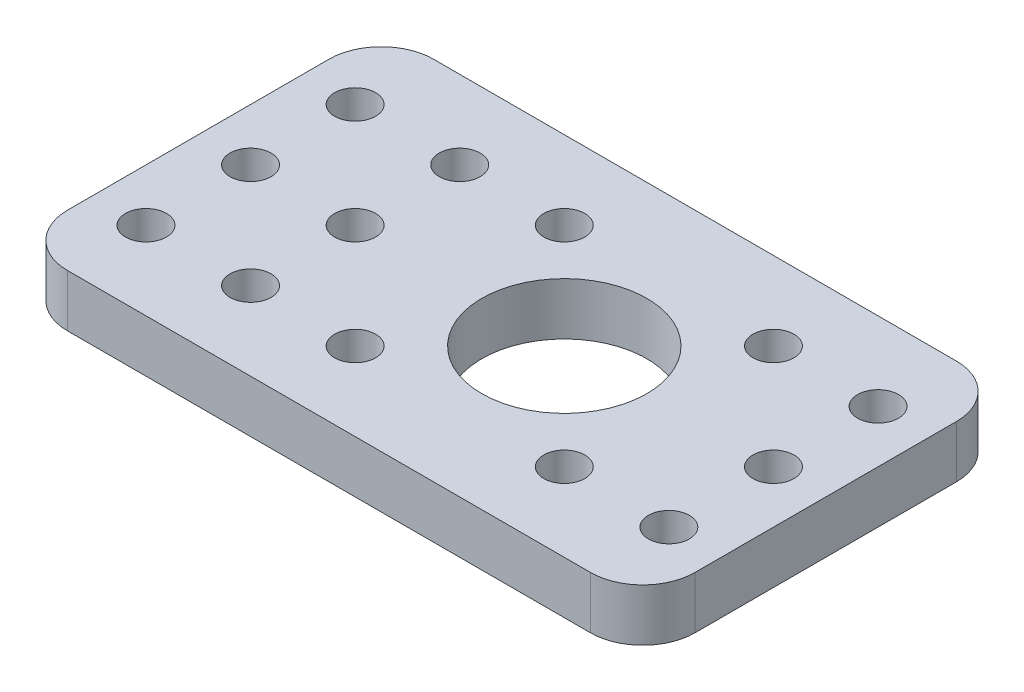
ISO-10303-21;
HEADER;
FILE_DESCRIPTION(('STEP AP214'),'2;1');
FILE_NAME('part.step','',(''),(''),'','','');
FILE_SCHEMA(('AUTOMOTIVE_DESIGN { 1 0 10303 214 1 1 1 1 }'));
ENDSEC;
DATA;
#1=APPLICATION_CONTEXT('core data for automotive mechanical design processes');
#2=APPLICATION_PROTOCOL_DEFINITION('international standard','automotive_design',2000,#1);
#3=PRODUCT_CONTEXT('',#1,'mechanical');
#4=PRODUCT('Part','Part','',(#3));
#5=PRODUCT_RELATED_PRODUCT_CATEGORY('part','',(#4));
#6=PRODUCT_DEFINITION_FORMATION('','',#4);
#7=PRODUCT_DEFINITION_CONTEXT('part definition',#1,'design');
#8=PRODUCT_DEFINITION('design','',#6,#7);
#9=PRODUCT_DEFINITION_SHAPE('','',#8);
#10=(LENGTH_UNIT() NAMED_UNIT(*) SI_UNIT(.MILLI.,.METRE.));
#11=(NAMED_UNIT(*) PLANE_ANGLE_UNIT() SI_UNIT($,.RADIAN.));
#12=(NAMED_UNIT(*) SI_UNIT($,.STERADIAN.) SOLID_ANGLE_UNIT());
#13=UNCERTAINTY_MEASURE_WITH_UNIT(LENGTH_MEASURE(1.E-05),#10,'distance_accuracy_value','');
#14=(GEOMETRIC_REPRESENTATION_CONTEXT(3) GLOBAL_UNCERTAINTY_ASSIGNED_CONTEXT((#13)) GLOBAL_UNIT_ASSIGNED_CONTEXT((#10,
#11,#12)) REPRESENTATION_CONTEXT('',''));
#15=CARTESIAN_POINT('',(0.,0.,0.));
#16=DIRECTION('',(0.,0.,1.));
#17=DIRECTION('',(1.,0.,0.));
#18=AXIS2_PLACEMENT_3D('',#15,#16,#17);
#19=CARTESIAN_POINT('',(0.,6.35,0.));
#20=DIRECTION('',(1.,0.,0.));
#21=DIRECTION('',(0.,0.,-1.));
#22=AXIS2_PLACEMENT_3D('',#19,#20,#21);
#23=PLANE('',#22);
#24=DIRECTION('',(0.,0.,1.));
#25=VECTOR('',#24,1.);
#26=CARTESIAN_POINT('',(0.,6.35,0.));
#27=LINE('',#26,#25);
#28=CARTESIAN_POINT('',(0.,6.35,-38.1));
#29=VERTEX_POINT('',#28);
#30=CARTESIAN_POINT('',(0.,6.35,-6.35));
#31=VERTEX_POINT('',#30);
#32=EDGE_CURVE('E121',#29,#31,#27,.T.);
#33=ORIENTED_EDGE('',*,*,#32,.F.);
#34=DIRECTION('',(0.,-1.,0.));
#35=VECTOR('',#34,1.);
#36=CARTESIAN_POINT('',(0.,6.35,-38.1));
#37=LINE('',#36,#35);
#38=CARTESIAN_POINT('',(0.,0.,-38.1));
#39=VERTEX_POINT('',#38);
#40=EDGE_CURVE('E106',#29,#39,#37,.T.);
#41=ORIENTED_EDGE('',*,*,#40,.T.);
#42=DIRECTION('',(0.,0.,1.));
#43=VECTOR('',#42,1.);
#44=CARTESIAN_POINT('',(0.,0.,0.));
#45=LINE('',#44,#43);
#46=CARTESIAN_POINT('',(0.,0.,-6.35));
#47=VERTEX_POINT('',#46);
#48=EDGE_CURVE('E118',#39,#47,#45,.T.);
#49=ORIENTED_EDGE('',*,*,#48,.T.);
#50=DIRECTION('',(0.,-1.,0.));
#51=VECTOR('',#50,1.);
#52=CARTESIAN_POINT('',(0.,6.35,-6.35));
#53=LINE('',#52,#51);
#54=EDGE_CURVE('E123',#47,#31,#53,.F.);
#55=ORIENTED_EDGE('',*,*,#54,.T.);
#56=EDGE_LOOP('',(#33,#41,#49,#55));
#57=FACE_BOUND('',#56,.T.);
#58=ADVANCED_FACE('F35',(#57),#23,.F.);
#59=CARTESIAN_POINT('',(0.,6.35,0.));
#60=DIRECTION('',(0.,0.,-1.));
#61=DIRECTION('',(-1.,0.,0.));
#62=AXIS2_PLACEMENT_3D('',#59,#60,#61);
#63=PLANE('',#62);
#64=DIRECTION('',(1.,0.,0.));
#65=VECTOR('',#64,1.);
#66=CARTESIAN_POINT('',(0.,6.35,0.));
#67=LINE('',#66,#65);
#68=CARTESIAN_POINT('',(6.35,6.35,0.));
#69=VERTEX_POINT('',#68);
#70=CARTESIAN_POINT('',(69.85,6.35,0.));
#71=VERTEX_POINT('',#70);
#72=EDGE_CURVE('E165',#69,#71,#67,.T.);
#73=ORIENTED_EDGE('',*,*,#72,.F.);
#74=DIRECTION('',(0.,-1.,0.));
#75=VECTOR('',#74,1.);
#76=CARTESIAN_POINT('',(6.35,6.35,0.));
#77=LINE('',#76,#75);
#78=CARTESIAN_POINT('',(6.35,0.,0.));
#79=VERTEX_POINT('',#78);
#80=EDGE_CURVE('E11',#69,#79,#77,.T.);
#81=ORIENTED_EDGE('',*,*,#80,.T.);
#82=DIRECTION('',(1.,0.,0.));
#83=VECTOR('',#82,1.);
#84=CARTESIAN_POINT('',(0.,0.,0.));
#85=LINE('',#84,#83);
#86=CARTESIAN_POINT('',(69.85,0.,0.));
#87=VERTEX_POINT('',#86);
#88=EDGE_CURVE('E128',#79,#87,#85,.T.);
#89=ORIENTED_EDGE('',*,*,#88,.T.);
#90=DIRECTION('',(0.,-1.,0.));
#91=VECTOR('',#90,1.);
#92=CARTESIAN_POINT('',(69.85,6.35,0.));
#93=LINE('',#92,#91);
#94=EDGE_CURVE('E43',#87,#71,#93,.F.);
#95=ORIENTED_EDGE('',*,*,#94,.T.);
#96=EDGE_LOOP('',(#73,#81,#89,#95));
#97=FACE_BOUND('',#96,.T.);
#98=ADVANCED_FACE('F164',(#97),#63,.F.);
#99=CARTESIAN_POINT('',(76.2,6.35,0.));
#100=DIRECTION('',(-1.,0.,0.));
#101=DIRECTION('',(0.,0.,1.));
#102=AXIS2_PLACEMENT_3D('',#99,#100,#101);
#103=PLANE('',#102);
#104=DIRECTION('',(0.,0.,-1.));
#105=VECTOR('',#104,1.);
#106=CARTESIAN_POINT('',(76.2,0.,0.));
#107=LINE('',#106,#105);
#108=CARTESIAN_POINT('',(76.2,0.,-6.35));
#109=VERTEX_POINT('',#108);
#110=CARTESIAN_POINT('',(76.2,0.,-38.1));
#111=VERTEX_POINT('',#110);
#112=EDGE_CURVE('E132',#109,#111,#107,.T.);
#113=ORIENTED_EDGE('',*,*,#112,.T.);
#114=DIRECTION('',(0.,-1.,0.));
#115=VECTOR('',#114,1.);
#116=CARTESIAN_POINT('',(76.2,6.35,-38.1));
#117=LINE('',#116,#115);
#118=CARTESIAN_POINT('',(76.2,6.35,-38.1));
#119=VERTEX_POINT('',#118);
#120=EDGE_CURVE('E50',#111,#119,#117,.F.);
#121=ORIENTED_EDGE('',*,*,#120,.T.);
#122=DIRECTION('',(0.,0.,-1.));
#123=VECTOR('',#122,1.);
#124=CARTESIAN_POINT('',(76.2,6.35,0.));
#125=LINE('',#124,#123);
#126=CARTESIAN_POINT('',(76.2,6.35,-6.35));
#127=VERTEX_POINT('',#126);
#128=EDGE_CURVE('E171',#127,#119,#125,.T.);
#129=ORIENTED_EDGE('',*,*,#128,.F.);
#130=DIRECTION('',(0.,-1.,0.));
#131=VECTOR('',#130,1.);
#132=CARTESIAN_POINT('',(76.2,6.35,-6.35));
#133=LINE('',#132,#131);
#134=EDGE_CURVE('E158',#127,#109,#133,.T.);
#135=ORIENTED_EDGE('',*,*,#134,.T.);
#136=EDGE_LOOP('',(#113,#121,#129,#135));
#137=FACE_BOUND('',#136,.T.);
#138=ADVANCED_FACE('F175',(#137),#103,.F.);
#139=CARTESIAN_POINT('',(0.,6.35,-44.45));
#140=DIRECTION('',(0.,0.,1.));
#141=DIRECTION('',(1.,0.,0.));
#142=AXIS2_PLACEMENT_3D('',#139,#140,#141);
#143=PLANE('',#142);
#144=DIRECTION('',(-1.,0.,0.));
#145=VECTOR('',#144,1.);
#146=CARTESIAN_POINT('',(0.,0.,-44.45));
#147=LINE('',#146,#145);
#148=CARTESIAN_POINT('',(69.85,0.,-44.45));
#149=VERTEX_POINT('',#148);
#150=CARTESIAN_POINT('',(6.35,0.,-44.45));
#151=VERTEX_POINT('',#150);
#152=EDGE_CURVE('E142',#149,#151,#147,.T.);
#153=ORIENTED_EDGE('',*,*,#152,.T.);
#154=DIRECTION('',(0.,-1.,0.));
#155=VECTOR('',#154,1.);
#156=CARTESIAN_POINT('',(6.35,6.35,-44.45));
#157=LINE('',#156,#155);
#158=CARTESIAN_POINT('',(6.35,6.35,-44.45));
#159=VERTEX_POINT('',#158);
#160=EDGE_CURVE('E107',#151,#159,#157,.F.);
#161=ORIENTED_EDGE('',*,*,#160,.T.);
#162=DIRECTION('',(-1.,0.,0.));
#163=VECTOR('',#162,1.);
#164=CARTESIAN_POINT('',(0.,6.35,-44.45));
#165=LINE('',#164,#163);
#166=CARTESIAN_POINT('',(69.85,6.35,-44.45));
#167=VERTEX_POINT('',#166);
#168=EDGE_CURVE('E138',#167,#159,#165,.T.);
#169=ORIENTED_EDGE('',*,*,#168,.F.);
#170=DIRECTION('',(0.,-1.,0.));
#171=VECTOR('',#170,1.);
#172=CARTESIAN_POINT('',(69.85,6.35,-44.45));
#173=LINE('',#172,#171);
#174=EDGE_CURVE('E112',#167,#149,#173,.T.);
#175=ORIENTED_EDGE('',*,*,#174,.T.);
#176=EDGE_LOOP('',(#153,#161,#169,#175));
#177=FACE_BOUND('',#176,.T.);
#178=ADVANCED_FACE('F182',(#177),#143,.F.);
#179=CARTESIAN_POINT('',(0.,6.35,0.));
#180=DIRECTION('',(0.,-1.,0.));
#181=DIRECTION('',(0.,0.,-1.));
#182=AXIS2_PLACEMENT_3D('',#179,#180,#181);
#183=PLANE('',#182);
#184=CARTESIAN_POINT('',(6.35000000000002,6.35,-34.9249999999999));
#185=DIRECTION('',(0.,1.,0.));
#186=DIRECTION('',(0.,0.,1.));
#187=AXIS2_PLACEMENT_3D('',#184,#185,#186);
#188=CIRCLE('',#187,2.48919999999997);
#189=CARTESIAN_POINT('',(6.35000000000002,6.35,-32.4357999999999));
#190=VERTEX_POINT('',#189);
#191=EDGE_CURVE('E231',#190,#190,#188,.T.);
#192=ORIENTED_EDGE('',*,*,#191,.F.);
#193=EDGE_LOOP('',(#192));
#194=FACE_BOUND('',#193,.T.);
#195=CARTESIAN_POINT('',(19.05,6.35,-34.9249999999999));
#196=DIRECTION('',(0.,1.,0.));
#197=DIRECTION('',(0.,0.,1.));
#198=AXIS2_PLACEMENT_3D('',#195,#196,#197);
#199=CIRCLE('',#198,2.48919999999997);
#200=CARTESIAN_POINT('',(19.05,6.35,-32.4357999999999));
#201=VERTEX_POINT('',#200);
#202=EDGE_CURVE('E225',#201,#201,#199,.T.);
#203=ORIENTED_EDGE('',*,*,#202,.F.);
#204=EDGE_LOOP('',(#203));
#205=FACE_BOUND('',#204,.T.);
#206=CARTESIAN_POINT('',(19.05,6.35,-22.2249999999999));
#207=DIRECTION('',(0.,1.,0.));
#208=DIRECTION('',(0.,0.,1.));
#209=AXIS2_PLACEMENT_3D('',#206,#207,#208);
#210=CIRCLE('',#209,2.48919999999997);
#211=CARTESIAN_POINT('',(19.05,6.35,-19.7357999999999));
#212=VERTEX_POINT('',#211);
#213=EDGE_CURVE('E219',#212,#212,#210,.T.);
#214=ORIENTED_EDGE('',*,*,#213,.F.);
#215=EDGE_LOOP('',(#214));
#216=FACE_BOUND('',#215,.T.);
#217=CARTESIAN_POINT('',(6.34999999999999,6.35,-22.2249999999999));
#218=DIRECTION('',(0.,1.,0.));
#219=DIRECTION('',(0.,0.,1.));
#220=AXIS2_PLACEMENT_3D('',#217,#218,#219);
#221=CIRCLE('',#220,2.48919999999997);
#222=CARTESIAN_POINT('',(6.34999999999999,6.35,-19.7357999999999));
#223=VERTEX_POINT('',#222);
#224=EDGE_CURVE('E213',#223,#223,#221,.T.);
#225=ORIENTED_EDGE('',*,*,#224,.F.);
#226=EDGE_LOOP('',(#225));
#227=FACE_BOUND('',#226,.T.);
#228=CARTESIAN_POINT('',(6.34999999999999,6.35,-9.52499999999992));
#229=DIRECTION('',(0.,1.,0.));
#230=DIRECTION('',(0.,0.,1.));
#231=AXIS2_PLACEMENT_3D('',#228,#229,#230);
#232=CIRCLE('',#231,2.48919999999997);
#233=CARTESIAN_POINT('',(6.34999999999999,6.35,-7.03579999999995));
#234=VERTEX_POINT('',#233);
#235=EDGE_CURVE('E207',#234,#234,#232,.T.);
#236=ORIENTED_EDGE('',*,*,#235,.F.);
#237=EDGE_LOOP('',(#236));
#238=FACE_BOUND('',#237,.T.);
#239=CARTESIAN_POINT('',(19.05,6.35,-9.52499999999992));
#240=DIRECTION('',(0.,1.,0.));
#241=DIRECTION('',(0.,0.,1.));
#242=AXIS2_PLACEMENT_3D('',#239,#240,#241);
#243=CIRCLE('',#242,2.48919999999997);
#244=CARTESIAN_POINT('',(19.05,6.35,-7.03579999999995));
#245=VERTEX_POINT('',#244);
#246=EDGE_CURVE('E201',#245,#245,#243,.T.);
#247=ORIENTED_EDGE('',*,*,#246,.F.);
#248=EDGE_LOOP('',(#247));
#249=FACE_BOUND('',#248,.T.);
#250=CARTESIAN_POINT('',(31.75,6.35,-9.52499999999992));
#251=DIRECTION('',(0.,1.,0.));
#252=DIRECTION('',(0.,0.,1.));
#253=AXIS2_PLACEMENT_3D('',#250,#251,#252);
#254=CIRCLE('',#253,2.48919999999997);
#255=CARTESIAN_POINT('',(31.75,6.35,-7.03579999999996));
#256=VERTEX_POINT('',#255);
#257=EDGE_CURVE('E195',#256,#256,#254,.T.);
#258=ORIENTED_EDGE('',*,*,#257,.F.);
#259=EDGE_LOOP('',(#258));
#260=FACE_BOUND('',#259,.T.);
#261=CARTESIAN_POINT('',(57.15,6.35,-9.52499999999992));
#262=DIRECTION('',(0.,1.,0.));
#263=DIRECTION('',(0.,0.,1.));
#264=AXIS2_PLACEMENT_3D('',#261,#262,#263);
#265=CIRCLE('',#264,2.48919999999999);
#266=CARTESIAN_POINT('',(57.15,6.35,-7.03579999999993));
#267=VERTEX_POINT('',#266);
#268=EDGE_CURVE('E188',#267,#267,#265,.T.);
#269=ORIENTED_EDGE('',*,*,#268,.F.);
#270=EDGE_LOOP('',(#269));
#271=FACE_BOUND('',#270,.T.);
#272=CARTESIAN_POINT('',(69.85,6.35,-9.52499999999992));
#273=DIRECTION('',(0.,1.,0.));
#274=DIRECTION('',(0.,0.,1.));
#275=AXIS2_PLACEMENT_3D('',#272,#273,#274);
#276=CIRCLE('',#275,2.48919999999997);
#277=CARTESIAN_POINT('',(69.85,6.35,-7.03579999999995));
#278=VERTEX_POINT('',#277);
#279=EDGE_CURVE('E260',#278,#278,#276,.T.);
#280=ORIENTED_EDGE('',*,*,#279,.F.);
#281=EDGE_LOOP('',(#280));
#282=FACE_BOUND('',#281,.T.);
#283=CARTESIAN_POINT('',(69.85,6.35,-22.2249999999999));
#284=DIRECTION('',(0.,1.,0.));
#285=DIRECTION('',(0.,0.,1.));
#286=AXIS2_PLACEMENT_3D('',#283,#284,#285);
#287=CIRCLE('',#286,2.48919999999997);
#288=CARTESIAN_POINT('',(69.85,6.35,-19.7357999999999));
#289=VERTEX_POINT('',#288);
#290=EDGE_CURVE('E254',#289,#289,#287,.T.);
#291=ORIENTED_EDGE('',*,*,#290,.F.);
#292=EDGE_LOOP('',(#291));
#293=FACE_BOUND('',#292,.T.);
#294=CARTESIAN_POINT('',(69.85,6.35,-34.9249999999999));
#295=DIRECTION('',(0.,1.,0.));
#296=DIRECTION('',(0.,0.,1.));
#297=AXIS2_PLACEMENT_3D('',#294,#295,#296);
#298=CIRCLE('',#297,2.48919999999997);
#299=CARTESIAN_POINT('',(69.85,6.35,-32.4357999999999));
#300=VERTEX_POINT('',#299);
#301=EDGE_CURVE('E248',#300,#300,#298,.T.);
#302=ORIENTED_EDGE('',*,*,#301,.F.);
#303=EDGE_LOOP('',(#302));
#304=FACE_BOUND('',#303,.T.);
#305=CARTESIAN_POINT('',(57.15,6.35,-34.9249999999999));
#306=DIRECTION('',(0.,1.,0.));
#307=DIRECTION('',(0.,0.,1.));
#308=AXIS2_PLACEMENT_3D('',#305,#306,#307);
#309=CIRCLE('',#308,2.48919999999999);
#310=CARTESIAN_POINT('',(57.15,6.35,-32.4357999999999));
#311=VERTEX_POINT('',#310);
#312=EDGE_CURVE('E242',#311,#311,#309,.T.);
#313=ORIENTED_EDGE('',*,*,#312,.F.);
#314=EDGE_LOOP('',(#313));
#315=FACE_BOUND('',#314,.T.);
#316=CARTESIAN_POINT('',(44.45,6.35,-22.225));
#317=DIRECTION('',(0.,1.,0.));
#318=DIRECTION('',(0.,0.,1.));
#319=AXIS2_PLACEMENT_3D('',#316,#317,#318);
#320=CIRCLE('',#319,10.025399939);
#321=CARTESIAN_POINT('',(44.45,6.35,-12.199600061));
#322=VERTEX_POINT('',#321);
#323=EDGE_CURVE('E236',#322,#322,#320,.T.);
#324=ORIENTED_EDGE('',*,*,#323,.F.);
#325=EDGE_LOOP('',(#324));
#326=FACE_BOUND('',#325,.T.);
#327=CARTESIAN_POINT('',(31.75,6.35,-34.9249999999999));
#328=DIRECTION('',(0.,1.,0.));
#329=DIRECTION('',(0.,0.,1.));
#330=AXIS2_PLACEMENT_3D('',#327,#328,#329);
#331=CIRCLE('',#330,2.48919999999997);
#332=CARTESIAN_POINT('',(31.75,6.35,-32.4357999999999));
#333=VERTEX_POINT('',#332);
#334=EDGE_CURVE('E135',#333,#333,#331,.T.);
#335=ORIENTED_EDGE('',*,*,#334,.F.);
#336=EDGE_LOOP('',(#335));
#337=FACE_BOUND('',#336,.T.);
#338=ORIENTED_EDGE('',*,*,#168,.T.);
#339=CARTESIAN_POINT('',(6.35,6.35,-38.1));
#340=DIRECTION('',(0.,-1.,0.));
#341=DIRECTION('',(0.,0.,-1.));
#342=AXIS2_PLACEMENT_3D('',#339,#340,#341);
#343=CIRCLE('',#342,6.35);
#344=EDGE_CURVE('E156',#159,#29,#343,.F.);
#345=ORIENTED_EDGE('',*,*,#344,.T.);
#346=ORIENTED_EDGE('',*,*,#32,.T.);
#347=CARTESIAN_POINT('',(6.35,6.35,-6.35));
#348=DIRECTION('',(0.,-1.,0.));
#349=DIRECTION('',(0.,0.,-1.));
#350=AXIS2_PLACEMENT_3D('',#347,#348,#349);
#351=CIRCLE('',#350,6.35);
#352=EDGE_CURVE('E152',#31,#69,#351,.F.);
#353=ORIENTED_EDGE('',*,*,#352,.T.);
#354=ORIENTED_EDGE('',*,*,#72,.T.);
#355=CARTESIAN_POINT('',(69.85,6.35,-6.35));
#356=DIRECTION('',(0.,-1.,0.));
#357=DIRECTION('',(0.,0.,-1.));
#358=AXIS2_PLACEMENT_3D('',#355,#356,#357);
#359=CIRCLE('',#358,6.35);
#360=EDGE_CURVE('E57',#71,#127,#359,.F.);
#361=ORIENTED_EDGE('',*,*,#360,.T.);
#362=ORIENTED_EDGE('',*,*,#128,.T.);
#363=CARTESIAN_POINT('',(69.85,6.35,-38.1));
#364=DIRECTION('',(0.,-1.,0.));
#365=DIRECTION('',(0.,0.,-1.));
#366=AXIS2_PLACEMENT_3D('',#363,#364,#365);
#367=CIRCLE('',#366,6.35);
#368=EDGE_CURVE('E154',#119,#167,#367,.F.);
#369=ORIENTED_EDGE('',*,*,#368,.T.);
#370=EDGE_LOOP('',(#338,#345,#346,#353,#354,#361,#362,#369));
#371=FACE_BOUND('',#370,.T.);
#372=ADVANCED_FACE('F169',(#194,#205,#216,#227,#238,#249,#260,#271,#282,#293,#304,#315,#326,
#337,#371),#183,.F.);
#373=CARTESIAN_POINT('',(0.,0.,0.));
#374=DIRECTION('',(0.,-1.,0.));
#375=DIRECTION('',(0.,0.,-1.));
#376=AXIS2_PLACEMENT_3D('',#373,#374,#375);
#377=PLANE('',#376);
#378=CARTESIAN_POINT('',(6.35000000000002,0.,-34.9249999999999));
#379=DIRECTION('',(0.,1.,0.));
#380=DIRECTION('',(0.,0.,1.));
#381=AXIS2_PLACEMENT_3D('',#378,#379,#380);
#382=CIRCLE('',#381,2.48919999999997);
#383=CARTESIAN_POINT('',(6.35000000000002,0.,-32.4357999999999));
#384=VERTEX_POINT('',#383);
#385=EDGE_CURVE('E186',#384,#384,#382,.T.);
#386=ORIENTED_EDGE('',*,*,#385,.T.);
#387=EDGE_LOOP('',(#386));
#388=FACE_BOUND('',#387,.T.);
#389=CARTESIAN_POINT('',(19.05,0.,-34.9249999999999));
#390=DIRECTION('',(0.,1.,0.));
#391=DIRECTION('',(0.,0.,1.));
#392=AXIS2_PLACEMENT_3D('',#389,#390,#391);
#393=CIRCLE('',#392,2.48919999999997);
#394=CARTESIAN_POINT('',(19.05,0.,-32.4357999999999));
#395=VERTEX_POINT('',#394);
#396=EDGE_CURVE('E228',#395,#395,#393,.T.);
#397=ORIENTED_EDGE('',*,*,#396,.T.);
#398=EDGE_LOOP('',(#397));
#399=FACE_BOUND('',#398,.T.);
#400=CARTESIAN_POINT('',(19.05,0.,-22.2249999999999));
#401=DIRECTION('',(0.,1.,0.));
#402=DIRECTION('',(0.,0.,1.));
#403=AXIS2_PLACEMENT_3D('',#400,#401,#402);
#404=CIRCLE('',#403,2.48919999999997);
#405=CARTESIAN_POINT('',(19.05,0.,-19.7357999999999));
#406=VERTEX_POINT('',#405);
#407=EDGE_CURVE('E222',#406,#406,#404,.T.);
#408=ORIENTED_EDGE('',*,*,#407,.T.);
#409=EDGE_LOOP('',(#408));
#410=FACE_BOUND('',#409,.T.);
#411=CARTESIAN_POINT('',(6.34999999999999,0.,-22.2249999999999));
#412=DIRECTION('',(0.,1.,0.));
#413=DIRECTION('',(0.,0.,1.));
#414=AXIS2_PLACEMENT_3D('',#411,#412,#413);
#415=CIRCLE('',#414,2.48919999999997);
#416=CARTESIAN_POINT('',(6.34999999999999,0.,-19.7357999999999));
#417=VERTEX_POINT('',#416);
#418=EDGE_CURVE('E216',#417,#417,#415,.T.);
#419=ORIENTED_EDGE('',*,*,#418,.T.);
#420=EDGE_LOOP('',(#419));
#421=FACE_BOUND('',#420,.T.);
#422=CARTESIAN_POINT('',(6.34999999999999,0.,-9.52499999999992));
#423=DIRECTION('',(0.,1.,0.));
#424=DIRECTION('',(0.,0.,1.));
#425=AXIS2_PLACEMENT_3D('',#422,#423,#424);
#426=CIRCLE('',#425,2.48919999999997);
#427=CARTESIAN_POINT('',(6.34999999999999,0.,-7.03579999999995));
#428=VERTEX_POINT('',#427);
#429=EDGE_CURVE('E210',#428,#428,#426,.T.);
#430=ORIENTED_EDGE('',*,*,#429,.T.);
#431=EDGE_LOOP('',(#430));
#432=FACE_BOUND('',#431,.T.);
#433=CARTESIAN_POINT('',(19.05,0.,-9.52499999999992));
#434=DIRECTION('',(0.,1.,0.));
#435=DIRECTION('',(0.,0.,1.));
#436=AXIS2_PLACEMENT_3D('',#433,#434,#435);
#437=CIRCLE('',#436,2.48919999999997);
#438=CARTESIAN_POINT('',(19.05,0.,-7.03579999999995));
#439=VERTEX_POINT('',#438);
#440=EDGE_CURVE('E204',#439,#439,#437,.T.);
#441=ORIENTED_EDGE('',*,*,#440,.T.);
#442=EDGE_LOOP('',(#441));
#443=FACE_BOUND('',#442,.T.);
#444=CARTESIAN_POINT('',(31.75,0.,-9.52499999999992));
#445=DIRECTION('',(0.,1.,0.));
#446=DIRECTION('',(0.,0.,1.));
#447=AXIS2_PLACEMENT_3D('',#444,#445,#446);
#448=CIRCLE('',#447,2.48919999999997);
#449=CARTESIAN_POINT('',(31.75,0.,-7.03579999999996));
#450=VERTEX_POINT('',#449);
#451=EDGE_CURVE('E198',#450,#450,#448,.T.);
#452=ORIENTED_EDGE('',*,*,#451,.T.);
#453=EDGE_LOOP('',(#452));
#454=FACE_BOUND('',#453,.T.);
#455=CARTESIAN_POINT('',(57.15,0.,-9.52499999999992));
#456=DIRECTION('',(0.,1.,0.));
#457=DIRECTION('',(0.,0.,1.));
#458=AXIS2_PLACEMENT_3D('',#455,#456,#457);
#459=CIRCLE('',#458,2.48919999999999);
#460=CARTESIAN_POINT('',(57.15,0.,-7.03579999999993));
#461=VERTEX_POINT('',#460);
#462=EDGE_CURVE('E191',#461,#461,#459,.T.);
#463=ORIENTED_EDGE('',*,*,#462,.T.);
#464=EDGE_LOOP('',(#463));
#465=FACE_BOUND('',#464,.T.);
#466=CARTESIAN_POINT('',(69.85,0.,-9.52499999999992));
#467=DIRECTION('',(0.,1.,0.));
#468=DIRECTION('',(0.,0.,1.));
#469=AXIS2_PLACEMENT_3D('',#466,#467,#468);
#470=CIRCLE('',#469,2.48919999999997);
#471=CARTESIAN_POINT('',(69.85,0.,-7.03579999999995));
#472=VERTEX_POINT('',#471);
#473=EDGE_CURVE('E192',#472,#472,#470,.T.);
#474=ORIENTED_EDGE('',*,*,#473,.T.);
#475=EDGE_LOOP('',(#474));
#476=FACE_BOUND('',#475,.T.);
#477=CARTESIAN_POINT('',(69.85,0.,-22.2249999999999));
#478=DIRECTION('',(0.,1.,0.));
#479=DIRECTION('',(0.,0.,1.));
#480=AXIS2_PLACEMENT_3D('',#477,#478,#479);
#481=CIRCLE('',#480,2.48919999999997);
#482=CARTESIAN_POINT('',(69.85,0.,-19.7357999999999));
#483=VERTEX_POINT('',#482);
#484=EDGE_CURVE('E257',#483,#483,#481,.T.);
#485=ORIENTED_EDGE('',*,*,#484,.T.);
#486=EDGE_LOOP('',(#485));
#487=FACE_BOUND('',#486,.T.);
#488=CARTESIAN_POINT('',(69.85,0.,-34.9249999999999));
#489=DIRECTION('',(0.,1.,0.));
#490=DIRECTION('',(0.,0.,1.));
#491=AXIS2_PLACEMENT_3D('',#488,#489,#490);
#492=CIRCLE('',#491,2.48919999999997);
#493=CARTESIAN_POINT('',(69.85,0.,-32.4357999999999));
#494=VERTEX_POINT('',#493);
#495=EDGE_CURVE('E251',#494,#494,#492,.T.);
#496=ORIENTED_EDGE('',*,*,#495,.T.);
#497=EDGE_LOOP('',(#496));
#498=FACE_BOUND('',#497,.T.);
#499=CARTESIAN_POINT('',(57.15,0.,-34.9249999999999));
#500=DIRECTION('',(0.,1.,0.));
#501=DIRECTION('',(0.,0.,1.));
#502=AXIS2_PLACEMENT_3D('',#499,#500,#501);
#503=CIRCLE('',#502,2.48919999999999);
#504=CARTESIAN_POINT('',(57.15,0.,-32.4357999999999));
#505=VERTEX_POINT('',#504);
#506=EDGE_CURVE('E245',#505,#505,#503,.T.);
#507=ORIENTED_EDGE('',*,*,#506,.T.);
#508=EDGE_LOOP('',(#507));
#509=FACE_BOUND('',#508,.T.);
#510=CARTESIAN_POINT('',(44.45,0.,-22.225));
#511=DIRECTION('',(0.,1.,0.));
#512=DIRECTION('',(0.,0.,1.));
#513=AXIS2_PLACEMENT_3D('',#510,#511,#512);
#514=CIRCLE('',#513,10.025399939);
#515=CARTESIAN_POINT('',(44.45,0.,-12.199600061));
#516=VERTEX_POINT('',#515);
#517=EDGE_CURVE('E239',#516,#516,#514,.T.);
#518=ORIENTED_EDGE('',*,*,#517,.T.);
#519=EDGE_LOOP('',(#518));
#520=FACE_BOUND('',#519,.T.);
#521=CARTESIAN_POINT('',(31.75,0.,-34.9249999999999));
#522=DIRECTION('',(0.,1.,0.));
#523=DIRECTION('',(0.,0.,1.));
#524=AXIS2_PLACEMENT_3D('',#521,#522,#523);
#525=CIRCLE('',#524,2.48919999999997);
#526=CARTESIAN_POINT('',(31.75,0.,-32.4357999999999));
#527=VERTEX_POINT('',#526);
#528=EDGE_CURVE('E129',#527,#527,#525,.T.);
#529=ORIENTED_EDGE('',*,*,#528,.T.);
#530=EDGE_LOOP('',(#529));
#531=FACE_BOUND('',#530,.T.);
#532=ORIENTED_EDGE('',*,*,#48,.F.);
#533=CARTESIAN_POINT('',(6.35,0.,-38.1));
#534=DIRECTION('',(0.,-1.,0.));
#535=DIRECTION('',(0.,0.,-1.));
#536=AXIS2_PLACEMENT_3D('',#533,#534,#535);
#537=CIRCLE('',#536,6.35);
#538=EDGE_CURVE('E102',#39,#151,#537,.T.);
#539=ORIENTED_EDGE('',*,*,#538,.T.);
#540=ORIENTED_EDGE('',*,*,#152,.F.);
#541=CARTESIAN_POINT('',(69.85,0.,-38.1));
#542=DIRECTION('',(0.,-1.,0.));
#543=DIRECTION('',(0.,0.,-1.));
#544=AXIS2_PLACEMENT_3D('',#541,#542,#543);
#545=CIRCLE('',#544,6.35);
#546=EDGE_CURVE('E113',#149,#111,#545,.T.);
#547=ORIENTED_EDGE('',*,*,#546,.T.);
#548=ORIENTED_EDGE('',*,*,#112,.F.);
#549=CARTESIAN_POINT('',(69.85,0.,-6.35));
#550=DIRECTION('',(0.,-1.,0.));
#551=DIRECTION('',(0.,0.,-1.));
#552=AXIS2_PLACEMENT_3D('',#549,#550,#551);
#553=CIRCLE('',#552,6.35);
#554=EDGE_CURVE('E122',#109,#87,#553,.T.);
#555=ORIENTED_EDGE('',*,*,#554,.T.);
#556=ORIENTED_EDGE('',*,*,#88,.F.);
#557=CARTESIAN_POINT('',(6.35,0.,-6.35));
#558=DIRECTION('',(0.,-1.,0.));
#559=DIRECTION('',(0.,0.,-1.));
#560=AXIS2_PLACEMENT_3D('',#557,#558,#559);
#561=CIRCLE('',#560,6.35);
#562=EDGE_CURVE('E127',#79,#47,#561,.T.);
#563=ORIENTED_EDGE('',*,*,#562,.T.);
#564=EDGE_LOOP('',(#532,#539,#540,#547,#548,#555,#556,#563));
#565=FACE_BOUND('',#564,.T.);
#566=ADVANCED_FACE('F125',(#388,#399,#410,#421,#432,#443,#454,#465,#476,#487,#498,#509,#520,
#531,#565),#377,.T.);
#567=CARTESIAN_POINT('',(6.35,6.35,-38.1));
#568=DIRECTION('',(0.,-1.,0.));
#569=DIRECTION('',(0.,0.,-1.));
#570=AXIS2_PLACEMENT_3D('',#567,#568,#569);
#571=CYLINDRICAL_SURFACE('',#570,6.35);
#572=ORIENTED_EDGE('',*,*,#344,.F.);
#573=ORIENTED_EDGE('',*,*,#160,.F.);
#574=ORIENTED_EDGE('',*,*,#538,.F.);
#575=ORIENTED_EDGE('',*,*,#40,.F.);
#576=EDGE_LOOP('',(#572,#573,#574,#575));
#577=FACE_BOUND('',#576,.T.);
#578=ADVANCED_FACE('F105',(#577),#571,.T.);
#579=CARTESIAN_POINT('',(69.85,6.35,-38.1));
#580=DIRECTION('',(0.,-1.,0.));
#581=DIRECTION('',(0.,0.,-1.));
#582=AXIS2_PLACEMENT_3D('',#579,#580,#581);
#583=CYLINDRICAL_SURFACE('',#582,6.35);
#584=ORIENTED_EDGE('',*,*,#368,.F.);
#585=ORIENTED_EDGE('',*,*,#120,.F.);
#586=ORIENTED_EDGE('',*,*,#546,.F.);
#587=ORIENTED_EDGE('',*,*,#174,.F.);
#588=EDGE_LOOP('',(#584,#585,#586,#587));
#589=FACE_BOUND('',#588,.T.);
#590=ADVANCED_FACE('F179',(#589),#583,.T.);
#591=CARTESIAN_POINT('',(6.35,6.35,-6.35));
#592=DIRECTION('',(0.,-1.,0.));
#593=DIRECTION('',(0.,0.,-1.));
#594=AXIS2_PLACEMENT_3D('',#591,#592,#593);
#595=CYLINDRICAL_SURFACE('',#594,6.35);
#596=ORIENTED_EDGE('',*,*,#352,.F.);
#597=ORIENTED_EDGE('',*,*,#54,.F.);
#598=ORIENTED_EDGE('',*,*,#562,.F.);
#599=ORIENTED_EDGE('',*,*,#80,.F.);
#600=EDGE_LOOP('',(#596,#597,#598,#599));
#601=FACE_BOUND('',#600,.T.);
#602=ADVANCED_FACE('F302',(#601),#595,.T.);
#603=CARTESIAN_POINT('',(69.85,6.35,-6.35));
#604=DIRECTION('',(0.,-1.,0.));
#605=DIRECTION('',(0.,0.,-1.));
#606=AXIS2_PLACEMENT_3D('',#603,#604,#605);
#607=CYLINDRICAL_SURFACE('',#606,6.35);
#608=ORIENTED_EDGE('',*,*,#360,.F.);
#609=ORIENTED_EDGE('',*,*,#94,.F.);
#610=ORIENTED_EDGE('',*,*,#554,.F.);
#611=ORIENTED_EDGE('',*,*,#134,.F.);
#612=EDGE_LOOP('',(#608,#609,#610,#611));
#613=FACE_BOUND('',#612,.T.);
#614=ADVANCED_FACE('F37',(#613),#607,.T.);
#615=CARTESIAN_POINT('',(31.75,0.,-34.9249999999999));
#616=DIRECTION('',(0.,1.,0.));
#617=DIRECTION('',(0.,0.,1.));
#618=AXIS2_PLACEMENT_3D('',#615,#616,#617);
#619=CYLINDRICAL_SURFACE('',#618,2.48919999999997);
#620=ORIENTED_EDGE('',*,*,#528,.F.);
#621=EDGE_LOOP('',(#620));
#622=FACE_BOUND('',#621,.T.);
#623=ORIENTED_EDGE('',*,*,#334,.T.);
#624=EDGE_LOOP('',(#623));
#625=FACE_BOUND('',#624,.T.);
#626=ADVANCED_FACE('F290',(#622,#625),#619,.F.);
#627=CARTESIAN_POINT('',(44.45,0.,-22.225));
#628=DIRECTION('',(0.,1.,0.));
#629=DIRECTION('',(0.,0.,1.));
#630=AXIS2_PLACEMENT_3D('',#627,#628,#629);
#631=CYLINDRICAL_SURFACE('',#630,10.025399939);
#632=ORIENTED_EDGE('',*,*,#517,.F.);
#633=EDGE_LOOP('',(#632));
#634=FACE_BOUND('',#633,.T.);
#635=ORIENTED_EDGE('',*,*,#323,.T.);
#636=EDGE_LOOP('',(#635));
#637=FACE_BOUND('',#636,.T.);
#638=ADVANCED_FACE('F292',(#634,#637),#631,.F.);
#639=CARTESIAN_POINT('',(57.15,0.,-34.9249999999999));
#640=DIRECTION('',(0.,1.,0.));
#641=DIRECTION('',(0.,0.,1.));
#642=AXIS2_PLACEMENT_3D('',#639,#640,#641);
#643=CYLINDRICAL_SURFACE('',#642,2.48919999999999);
#644=ORIENTED_EDGE('',*,*,#506,.F.);
#645=EDGE_LOOP('',(#644));
#646=FACE_BOUND('',#645,.T.);
#647=ORIENTED_EDGE('',*,*,#312,.T.);
#648=EDGE_LOOP('',(#647));
#649=FACE_BOUND('',#648,.T.);
#650=ADVANCED_FACE('F299',(#646,#649),#643,.F.);
#651=CARTESIAN_POINT('',(69.85,0.,-34.9249999999999));
#652=DIRECTION('',(0.,1.,0.));
#653=DIRECTION('',(0.,0.,1.));
#654=AXIS2_PLACEMENT_3D('',#651,#652,#653);
#655=CYLINDRICAL_SURFACE('',#654,2.48919999999997);
#656=ORIENTED_EDGE('',*,*,#495,.F.);
#657=EDGE_LOOP('',(#656));
#658=FACE_BOUND('',#657,.T.);
#659=ORIENTED_EDGE('',*,*,#301,.T.);
#660=EDGE_LOOP('',(#659));
#661=FACE_BOUND('',#660,.T.);
#662=ADVANCED_FACE('F363',(#658,#661),#655,.F.);
#663=CARTESIAN_POINT('',(69.85,0.,-22.2249999999999));
#664=DIRECTION('',(0.,1.,0.));
#665=DIRECTION('',(0.,0.,1.));
#666=AXIS2_PLACEMENT_3D('',#663,#664,#665);
#667=CYLINDRICAL_SURFACE('',#666,2.48919999999997);
#668=ORIENTED_EDGE('',*,*,#484,.F.);
#669=EDGE_LOOP('',(#668));
#670=FACE_BOUND('',#669,.T.);
#671=ORIENTED_EDGE('',*,*,#290,.T.);
#672=EDGE_LOOP('',(#671));
#673=FACE_BOUND('',#672,.T.);
#674=ADVANCED_FACE('F272',(#670,#673),#667,.F.);
#675=CARTESIAN_POINT('',(69.85,0.,-9.52499999999992));
#676=DIRECTION('',(0.,1.,0.));
#677=DIRECTION('',(0.,0.,1.));
#678=AXIS2_PLACEMENT_3D('',#675,#676,#677);
#679=CYLINDRICAL_SURFACE('',#678,2.48919999999997);
#680=ORIENTED_EDGE('',*,*,#473,.F.);
#681=EDGE_LOOP('',(#680));
#682=FACE_BOUND('',#681,.T.);
#683=ORIENTED_EDGE('',*,*,#279,.T.);
#684=EDGE_LOOP('',(#683));
#685=FACE_BOUND('',#684,.T.);
#686=ADVANCED_FACE('F268',(#682,#685),#679,.F.);
#687=CARTESIAN_POINT('',(57.15,0.,-9.52499999999992));
#688=DIRECTION('',(0.,1.,0.));
#689=DIRECTION('',(0.,0.,1.));
#690=AXIS2_PLACEMENT_3D('',#687,#688,#689);
#691=CYLINDRICAL_SURFACE('',#690,2.48919999999999);
#692=ORIENTED_EDGE('',*,*,#462,.F.);
#693=EDGE_LOOP('',(#692));
#694=FACE_BOUND('',#693,.T.);
#695=ORIENTED_EDGE('',*,*,#268,.T.);
#696=EDGE_LOOP('',(#695));
#697=FACE_BOUND('',#696,.T.);
#698=ADVANCED_FACE('F271',(#694,#697),#691,.F.);
#699=CARTESIAN_POINT('',(31.75,0.,-9.52499999999992));
#700=DIRECTION('',(0.,1.,0.));
#701=DIRECTION('',(0.,0.,1.));
#702=AXIS2_PLACEMENT_3D('',#699,#700,#701);
#703=CYLINDRICAL_SURFACE('',#702,2.48919999999997);
#704=ORIENTED_EDGE('',*,*,#451,.F.);
#705=EDGE_LOOP('',(#704));
#706=FACE_BOUND('',#705,.T.);
#707=ORIENTED_EDGE('',*,*,#257,.T.);
#708=EDGE_LOOP('',(#707));
#709=FACE_BOUND('',#708,.T.);
#710=ADVANCED_FACE('F397',(#706,#709),#703,.F.);
#711=CARTESIAN_POINT('',(19.05,0.,-9.52499999999992));
#712=DIRECTION('',(0.,1.,0.));
#713=DIRECTION('',(0.,0.,1.));
#714=AXIS2_PLACEMENT_3D('',#711,#712,#713);
#715=CYLINDRICAL_SURFACE('',#714,2.48919999999997);
#716=ORIENTED_EDGE('',*,*,#440,.F.);
#717=EDGE_LOOP('',(#716));
#718=FACE_BOUND('',#717,.T.);
#719=ORIENTED_EDGE('',*,*,#246,.T.);
#720=EDGE_LOOP('',(#719));
#721=FACE_BOUND('',#720,.T.);
#722=ADVANCED_FACE('F406',(#718,#721),#715,.F.);
#723=CARTESIAN_POINT('',(6.34999999999999,0.,-9.52499999999992));
#724=DIRECTION('',(0.,1.,0.));
#725=DIRECTION('',(0.,0.,1.));
#726=AXIS2_PLACEMENT_3D('',#723,#724,#725);
#727=CYLINDRICAL_SURFACE('',#726,2.48919999999997);
#728=ORIENTED_EDGE('',*,*,#429,.F.);
#729=EDGE_LOOP('',(#728));
#730=FACE_BOUND('',#729,.T.);
#731=ORIENTED_EDGE('',*,*,#235,.T.);
#732=EDGE_LOOP('',(#731));
#733=FACE_BOUND('',#732,.T.);
#734=ADVANCED_FACE('F416',(#730,#733),#727,.F.);
#735=CARTESIAN_POINT('',(6.34999999999999,0.,-22.2249999999999));
#736=DIRECTION('',(0.,1.,0.));
#737=DIRECTION('',(0.,0.,1.));
#738=AXIS2_PLACEMENT_3D('',#735,#736,#737);
#739=CYLINDRICAL_SURFACE('',#738,2.48919999999997);
#740=ORIENTED_EDGE('',*,*,#418,.F.);
#741=EDGE_LOOP('',(#740));
#742=FACE_BOUND('',#741,.T.);
#743=ORIENTED_EDGE('',*,*,#224,.T.);
#744=EDGE_LOOP('',(#743));
#745=FACE_BOUND('',#744,.T.);
#746=ADVANCED_FACE('F426',(#742,#745),#739,.F.);
#747=CARTESIAN_POINT('',(19.05,0.,-22.2249999999999));
#748=DIRECTION('',(0.,1.,0.));
#749=DIRECTION('',(0.,0.,1.));
#750=AXIS2_PLACEMENT_3D('',#747,#748,#749);
#751=CYLINDRICAL_SURFACE('',#750,2.48919999999997);
#752=ORIENTED_EDGE('',*,*,#407,.F.);
#753=EDGE_LOOP('',(#752));
#754=FACE_BOUND('',#753,.T.);
#755=ORIENTED_EDGE('',*,*,#213,.T.);
#756=EDGE_LOOP('',(#755));
#757=FACE_BOUND('',#756,.T.);
#758=ADVANCED_FACE('F436',(#754,#757),#751,.F.);
#759=CARTESIAN_POINT('',(19.05,0.,-34.9249999999999));
#760=DIRECTION('',(0.,1.,0.));
#761=DIRECTION('',(0.,0.,1.));
#762=AXIS2_PLACEMENT_3D('',#759,#760,#761);
#763=CYLINDRICAL_SURFACE('',#762,2.48919999999997);
#764=ORIENTED_EDGE('',*,*,#396,.F.);
#765=EDGE_LOOP('',(#764));
#766=FACE_BOUND('',#765,.T.);
#767=ORIENTED_EDGE('',*,*,#202,.T.);
#768=EDGE_LOOP('',(#767));
#769=FACE_BOUND('',#768,.T.);
#770=ADVANCED_FACE('F446',(#766,#769),#763,.F.);
#771=CARTESIAN_POINT('',(6.35000000000002,0.,-34.9249999999999));
#772=DIRECTION('',(0.,1.,0.));
#773=DIRECTION('',(0.,0.,1.));
#774=AXIS2_PLACEMENT_3D('',#771,#772,#773);
#775=CYLINDRICAL_SURFACE('',#774,2.48919999999997);
#776=ORIENTED_EDGE('',*,*,#385,.F.);
#777=EDGE_LOOP('',(#776));
#778=FACE_BOUND('',#777,.T.);
#779=ORIENTED_EDGE('',*,*,#191,.T.);
#780=EDGE_LOOP('',(#779));
#781=FACE_BOUND('',#780,.T.);
#782=ADVANCED_FACE('F456',(#778,#781),#775,.F.);
#783=CLOSED_SHELL('',(#58,#98,#138,#178,#372,#566,#578,#590,#602,#614,#626,#638,#650,#662,#674,
#686,#698,#710,#722,#734,#746,#758,#770,#782));
#784=MANIFOLD_SOLID_BREP('B2',#783);
#785=ADVANCED_BREP_SHAPE_REPRESENTATION('',(#18,#784),#14);
#786=SHAPE_DEFINITION_REPRESENTATION(#9,#785);
ENDSEC;
END-ISO-10303-21;
